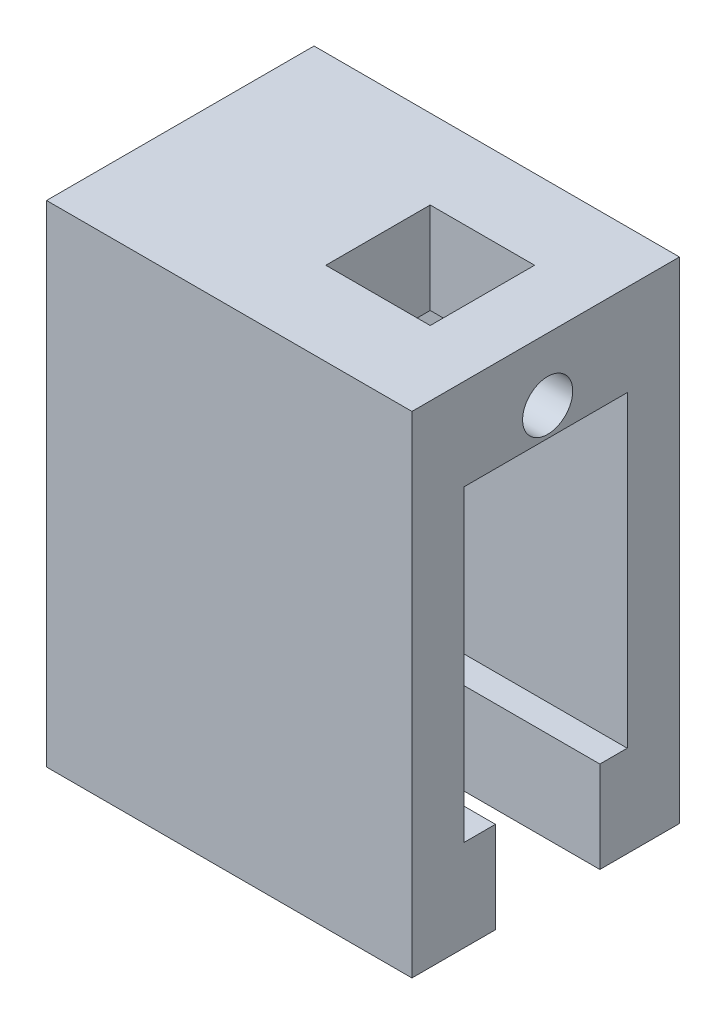
ISO-10303-21;
HEADER;
FILE_DESCRIPTION(('STEP AP214'),'2;1');
FILE_NAME('part.step','',(''),(''),'','','');
FILE_SCHEMA(('AUTOMOTIVE_DESIGN { 1 0 10303 214 1 1 1 1 }'));
ENDSEC;
DATA;
#1=APPLICATION_CONTEXT('core data for automotive mechanical design processes');
#2=APPLICATION_PROTOCOL_DEFINITION('international standard','automotive_design',2000,#1);
#3=PRODUCT_CONTEXT('',#1,'mechanical');
#4=PRODUCT('Part','Part','',(#3));
#5=PRODUCT_RELATED_PRODUCT_CATEGORY('part','',(#4));
#6=PRODUCT_DEFINITION_FORMATION('','',#4);
#7=PRODUCT_DEFINITION_CONTEXT('part definition',#1,'design');
#8=PRODUCT_DEFINITION('design','',#6,#7);
#9=PRODUCT_DEFINITION_SHAPE('','',#8);
#10=(LENGTH_UNIT() NAMED_UNIT(*) SI_UNIT(.MILLI.,.METRE.));
#11=(NAMED_UNIT(*) PLANE_ANGLE_UNIT() SI_UNIT($,.RADIAN.));
#12=(NAMED_UNIT(*) SI_UNIT($,.STERADIAN.) SOLID_ANGLE_UNIT());
#13=UNCERTAINTY_MEASURE_WITH_UNIT(LENGTH_MEASURE(1.E-05),#10,'distance_accuracy_value','');
#14=(GEOMETRIC_REPRESENTATION_CONTEXT(3) GLOBAL_UNCERTAINTY_ASSIGNED_CONTEXT((#13)) GLOBAL_UNIT_ASSIGNED_CONTEXT((#10,
#11,#12)) REPRESENTATION_CONTEXT('',''));
#15=CARTESIAN_POINT('',(0.,0.,0.));
#16=DIRECTION('',(0.,0.,1.));
#17=DIRECTION('',(1.,0.,0.));
#18=AXIS2_PLACEMENT_3D('',#15,#16,#17);
#19=CARTESIAN_POINT('',(28.,0.,0.));
#20=DIRECTION('',(-1.,0.,0.));
#21=DIRECTION('',(0.,0.,1.));
#22=AXIS2_PLACEMENT_3D('',#19,#20,#21);
#23=PLANE('',#22);
#24=CARTESIAN_POINT('',(28.,13.45,0.));
#25=DIRECTION('',(1.,0.,0.));
#26=DIRECTION('',(0.,0.,-1.));
#27=AXIS2_PLACEMENT_3D('',#24,#25,#26);
#28=CIRCLE('',#27,1.92);
#29=CARTESIAN_POINT('',(28.,13.45,-1.92));
#30=VERTEX_POINT('',#29);
#31=EDGE_CURVE('E211',#30,#30,#28,.T.);
#32=ORIENTED_EDGE('',*,*,#31,.F.);
#33=EDGE_LOOP('',(#32));
#34=FACE_BOUND('',#33,.T.);
#35=DIRECTION('',(0.,0.,-1.));
#36=VECTOR('',#35,1.);
#37=CARTESIAN_POINT('',(28.,-19.35,10.4));
#38=LINE('',#37,#36);
#39=CARTESIAN_POINT('',(28.,-19.35,10.4));
#40=VERTEX_POINT('',#39);
#41=CARTESIAN_POINT('',(28.,-19.35,4.));
#42=VERTEX_POINT('',#41);
#43=EDGE_CURVE('E257',#40,#42,#38,.T.);
#44=ORIENTED_EDGE('',*,*,#43,.T.);
#45=DIRECTION('',(0.,-1.,0.));
#46=VECTOR('',#45,1.);
#47=CARTESIAN_POINT('',(28.,-12.35,4.));
#48=LINE('',#47,#46);
#49=CARTESIAN_POINT('',(28.,-12.35,4.));
#50=VERTEX_POINT('',#49);
#51=EDGE_CURVE('E153',#50,#42,#48,.T.);
#52=ORIENTED_EDGE('',*,*,#51,.F.);
#53=DIRECTION('',(0.,0.,-1.));
#54=VECTOR('',#53,1.);
#55=CARTESIAN_POINT('',(28.,-12.35,6.4));
#56=LINE('',#55,#54);
#57=CARTESIAN_POINT('',(28.,-12.35,6.4));
#58=VERTEX_POINT('',#57);
#59=EDGE_CURVE('E224',#58,#50,#56,.T.);
#60=ORIENTED_EDGE('',*,*,#59,.F.);
#61=DIRECTION('',(0.,-1.,0.));
#62=VECTOR('',#61,1.);
#63=CARTESIAN_POINT('',(28.,-12.35,6.4));
#64=LINE('',#63,#62);
#65=CARTESIAN_POINT('',(28.,11.25,6.4));
#66=VERTEX_POINT('',#65);
#67=EDGE_CURVE('E220',#66,#58,#64,.T.);
#68=ORIENTED_EDGE('',*,*,#67,.F.);
#69=DIRECTION('',(0.,0.,1.));
#70=VECTOR('',#69,1.);
#71=CARTESIAN_POINT('',(28.,11.25,6.4));
#72=LINE('',#71,#70);
#73=CARTESIAN_POINT('',(28.,11.25,-6.1));
#74=VERTEX_POINT('',#73);
#75=EDGE_CURVE('E217',#74,#66,#72,.T.);
#76=ORIENTED_EDGE('',*,*,#75,.F.);
#77=DIRECTION('',(0.,1.,0.));
#78=VECTOR('',#77,1.);
#79=CARTESIAN_POINT('',(28.,-12.35,-6.1));
#80=LINE('',#79,#78);
#81=CARTESIAN_POINT('',(28.,-12.35,-6.1));
#82=VERTEX_POINT('',#81);
#83=EDGE_CURVE('E215',#82,#74,#80,.T.);
#84=ORIENTED_EDGE('',*,*,#83,.F.);
#85=CARTESIAN_POINT('',(28.,-12.35,-4.));
#86=VERTEX_POINT('',#85);
#87=EDGE_CURVE('E223',#86,#82,#56,.T.);
#88=ORIENTED_EDGE('',*,*,#87,.F.);
#89=DIRECTION('',(0.,1.,0.));
#90=VECTOR('',#89,1.);
#91=CARTESIAN_POINT('',(28.,-12.35,-4.));
#92=LINE('',#91,#90);
#93=CARTESIAN_POINT('',(28.,-19.35,-4.));
#94=VERTEX_POINT('',#93);
#95=EDGE_CURVE('E166',#94,#86,#92,.T.);
#96=ORIENTED_EDGE('',*,*,#95,.F.);
#97=CARTESIAN_POINT('',(28.,-19.35,-10.1));
#98=VERTEX_POINT('',#97);
#99=EDGE_CURVE('E256',#94,#98,#38,.T.);
#100=ORIENTED_EDGE('',*,*,#99,.T.);
#101=DIRECTION('',(0.,1.,0.));
#102=VECTOR('',#101,1.);
#103=CARTESIAN_POINT('',(28.,-19.35,-10.1));
#104=LINE('',#103,#102);
#105=CARTESIAN_POINT('',(28.,18.25,-10.1));
#106=VERTEX_POINT('',#105);
#107=EDGE_CURVE('E248',#98,#106,#104,.T.);
#108=ORIENTED_EDGE('',*,*,#107,.T.);
#109=DIRECTION('',(0.,0.,1.));
#110=VECTOR('',#109,1.);
#111=CARTESIAN_POINT('',(28.,18.25,10.4));
#112=LINE('',#111,#110);
#113=CARTESIAN_POINT('',(28.,18.25,10.4));
#114=VERTEX_POINT('',#113);
#115=EDGE_CURVE('E251',#106,#114,#112,.T.);
#116=ORIENTED_EDGE('',*,*,#115,.T.);
#117=DIRECTION('',(0.,-1.,0.));
#118=VECTOR('',#117,1.);
#119=CARTESIAN_POINT('',(28.,-19.35,10.4));
#120=LINE('',#119,#118);
#121=EDGE_CURVE('E254',#114,#40,#120,.T.);
#122=ORIENTED_EDGE('',*,*,#121,.T.);
#123=EDGE_LOOP('',(#44,#52,#60,#68,#76,#84,#88,#96,#100,#108,#116,#122));
#124=FACE_BOUND('',#123,.T.);
#125=ADVANCED_FACE('F34',(#34,#124),#23,.F.);
#126=CARTESIAN_POINT('',(0.,0.,0.));
#127=DIRECTION('',(-1.,0.,0.));
#128=DIRECTION('',(0.,0.,1.));
#129=AXIS2_PLACEMENT_3D('',#126,#127,#128);
#130=PLANE('',#129);
#131=DIRECTION('',(0.,1.,0.));
#132=VECTOR('',#131,1.);
#133=CARTESIAN_POINT('',(0.,-19.35,-10.1));
#134=LINE('',#133,#132);
#135=CARTESIAN_POINT('',(0.,-19.35,-10.1));
#136=VERTEX_POINT('',#135);
#137=CARTESIAN_POINT('',(0.,18.25,-10.1));
#138=VERTEX_POINT('',#137);
#139=EDGE_CURVE('E247',#136,#138,#134,.T.);
#140=ORIENTED_EDGE('',*,*,#139,.F.);
#141=DIRECTION('',(0.,0.,-1.));
#142=VECTOR('',#141,1.);
#143=CARTESIAN_POINT('',(0.,-19.35,10.4));
#144=LINE('',#143,#142);
#145=CARTESIAN_POINT('',(0.,-19.35,10.4));
#146=VERTEX_POINT('',#145);
#147=EDGE_CURVE('E252',#146,#136,#144,.T.);
#148=ORIENTED_EDGE('',*,*,#147,.F.);
#149=DIRECTION('',(0.,-1.,0.));
#150=VECTOR('',#149,1.);
#151=CARTESIAN_POINT('',(0.,-19.35,10.4));
#152=LINE('',#151,#150);
#153=CARTESIAN_POINT('',(0.,18.25,10.4));
#154=VERTEX_POINT('',#153);
#155=EDGE_CURVE('E264',#154,#146,#152,.T.);
#156=ORIENTED_EDGE('',*,*,#155,.F.);
#157=DIRECTION('',(0.,0.,1.));
#158=VECTOR('',#157,1.);
#159=CARTESIAN_POINT('',(0.,18.25,10.4));
#160=LINE('',#159,#158);
#161=EDGE_CURVE('E262',#138,#154,#160,.T.);
#162=ORIENTED_EDGE('',*,*,#161,.F.);
#163=EDGE_LOOP('',(#140,#148,#156,#162));
#164=FACE_BOUND('',#163,.T.);
#165=DIRECTION('',(0.,0.,-1.));
#166=VECTOR('',#165,1.);
#167=CARTESIAN_POINT('',(0.,-12.35,6.4));
#168=LINE('',#167,#166);
#169=CARTESIAN_POINT('',(0.,-12.35,6.4));
#170=VERTEX_POINT('',#169);
#171=CARTESIAN_POINT('',(0.,-12.35,-6.1));
#172=VERTEX_POINT('',#171);
#173=EDGE_CURVE('E218',#170,#172,#168,.T.);
#174=ORIENTED_EDGE('',*,*,#173,.T.);
#175=DIRECTION('',(0.,1.,0.));
#176=VECTOR('',#175,1.);
#177=CARTESIAN_POINT('',(0.,-12.35,-6.1));
#178=LINE('',#177,#176);
#179=CARTESIAN_POINT('',(0.,11.25,-6.1));
#180=VERTEX_POINT('',#179);
#181=EDGE_CURVE('E214',#172,#180,#178,.T.);
#182=ORIENTED_EDGE('',*,*,#181,.T.);
#183=DIRECTION('',(0.,0.,1.));
#184=VECTOR('',#183,1.);
#185=CARTESIAN_POINT('',(0.,11.25,6.4));
#186=LINE('',#185,#184);
#187=CARTESIAN_POINT('',(0.,11.25,6.4));
#188=VERTEX_POINT('',#187);
#189=EDGE_CURVE('E230',#180,#188,#186,.T.);
#190=ORIENTED_EDGE('',*,*,#189,.T.);
#191=DIRECTION('',(0.,-1.,0.));
#192=VECTOR('',#191,1.);
#193=CARTESIAN_POINT('',(0.,-12.35,6.4));
#194=LINE('',#193,#192);
#195=EDGE_CURVE('E233',#188,#170,#194,.T.);
#196=ORIENTED_EDGE('',*,*,#195,.T.);
#197=EDGE_LOOP('',(#174,#182,#190,#196));
#198=FACE_BOUND('',#197,.T.);
#199=ADVANCED_FACE('F283',(#164,#198),#130,.T.);
#200=CARTESIAN_POINT('',(28.,-19.35,-10.1));
#201=DIRECTION('',(0.,0.,1.));
#202=DIRECTION('',(1.,0.,0.));
#203=AXIS2_PLACEMENT_3D('',#200,#201,#202);
#204=PLANE('',#203);
#205=ORIENTED_EDGE('',*,*,#139,.T.);
#206=DIRECTION('',(-1.,0.,0.));
#207=VECTOR('',#206,1.);
#208=CARTESIAN_POINT('',(28.,18.25,-10.1));
#209=LINE('',#208,#207);
#210=EDGE_CURVE('E11',#106,#138,#209,.T.);
#211=ORIENTED_EDGE('',*,*,#210,.F.);
#212=ORIENTED_EDGE('',*,*,#107,.F.);
#213=DIRECTION('',(-1.,0.,0.));
#214=VECTOR('',#213,1.);
#215=CARTESIAN_POINT('',(28.,-19.35,-10.1));
#216=LINE('',#215,#214);
#217=EDGE_CURVE('E259',#98,#136,#216,.T.);
#218=ORIENTED_EDGE('',*,*,#217,.T.);
#219=EDGE_LOOP('',(#205,#211,#212,#218));
#220=FACE_BOUND('',#219,.T.);
#221=ADVANCED_FACE('F36',(#220),#204,.F.);
#222=CARTESIAN_POINT('',(28.,18.25,10.4));
#223=DIRECTION('',(0.,-1.,0.));
#224=DIRECTION('',(0.,0.,-1.));
#225=AXIS2_PLACEMENT_3D('',#222,#223,#224);
#226=PLANE('',#225);
#227=DIRECTION('',(-1.,0.,0.));
#228=VECTOR('',#227,1.);
#229=CARTESIAN_POINT('',(23.,18.25,-4.));
#230=LINE('',#229,#228);
#231=CARTESIAN_POINT('',(23.,18.25,-4.));
#232=VERTEX_POINT('',#231);
#233=CARTESIAN_POINT('',(15.,18.25,-4.));
#234=VERTEX_POINT('',#233);
#235=EDGE_CURVE('E58',#232,#234,#230,.T.);
#236=ORIENTED_EDGE('',*,*,#235,.F.);
#237=DIRECTION('',(0.,0.,1.));
#238=VECTOR('',#237,1.);
#239=CARTESIAN_POINT('',(23.,18.25,4.));
#240=LINE('',#239,#238);
#241=CARTESIAN_POINT('',(23.,18.25,4.));
#242=VERTEX_POINT('',#241);
#243=EDGE_CURVE('E189',#232,#242,#240,.T.);
#244=ORIENTED_EDGE('',*,*,#243,.T.);
#245=DIRECTION('',(-1.,0.,0.));
#246=VECTOR('',#245,1.);
#247=CARTESIAN_POINT('',(23.,18.25,4.));
#248=LINE('',#247,#246);
#249=CARTESIAN_POINT('',(15.,18.25,4.));
#250=VERTEX_POINT('',#249);
#251=EDGE_CURVE('E204',#242,#250,#248,.T.);
#252=ORIENTED_EDGE('',*,*,#251,.T.);
#253=DIRECTION('',(0.,0.,1.));
#254=VECTOR('',#253,1.);
#255=CARTESIAN_POINT('',(15.,18.25,4.));
#256=LINE('',#255,#254);
#257=EDGE_CURVE('E199',#234,#250,#256,.T.);
#258=ORIENTED_EDGE('',*,*,#257,.F.);
#259=EDGE_LOOP('',(#236,#244,#252,#258));
#260=FACE_BOUND('',#259,.T.);
#261=ORIENTED_EDGE('',*,*,#161,.T.);
#262=DIRECTION('',(-1.,0.,0.));
#263=VECTOR('',#262,1.);
#264=CARTESIAN_POINT('',(28.,18.25,10.4));
#265=LINE('',#264,#263);
#266=EDGE_CURVE('E43',#114,#154,#265,.T.);
#267=ORIENTED_EDGE('',*,*,#266,.F.);
#268=ORIENTED_EDGE('',*,*,#115,.F.);
#269=ORIENTED_EDGE('',*,*,#210,.T.);
#270=EDGE_LOOP('',(#261,#267,#268,#269));
#271=FACE_BOUND('',#270,.T.);
#272=ADVANCED_FACE('F317',(#260,#271),#226,.F.);
#273=CARTESIAN_POINT('',(28.,-19.35,10.4));
#274=DIRECTION('',(0.,0.,-1.));
#275=DIRECTION('',(-1.,0.,0.));
#276=AXIS2_PLACEMENT_3D('',#273,#274,#275);
#277=PLANE('',#276);
#278=ORIENTED_EDGE('',*,*,#155,.T.);
#279=DIRECTION('',(-1.,0.,0.));
#280=VECTOR('',#279,1.);
#281=CARTESIAN_POINT('',(28.,-19.35,10.4));
#282=LINE('',#281,#280);
#283=EDGE_CURVE('E269',#40,#146,#282,.T.);
#284=ORIENTED_EDGE('',*,*,#283,.F.);
#285=ORIENTED_EDGE('',*,*,#121,.F.);
#286=ORIENTED_EDGE('',*,*,#266,.T.);
#287=EDGE_LOOP('',(#278,#284,#285,#286));
#288=FACE_BOUND('',#287,.T.);
#289=ADVANCED_FACE('F277',(#288),#277,.F.);
#290=CARTESIAN_POINT('',(28.,-19.35,10.4));
#291=DIRECTION('',(0.,1.,0.));
#292=DIRECTION('',(0.,0.,1.));
#293=AXIS2_PLACEMENT_3D('',#290,#291,#292);
#294=PLANE('',#293);
#295=DIRECTION('',(0.,0.,-1.));
#296=VECTOR('',#295,1.);
#297=CARTESIAN_POINT('',(8.,-19.35,4.));
#298=LINE('',#297,#296);
#299=CARTESIAN_POINT('',(8.,-19.35,4.));
#300=VERTEX_POINT('',#299);
#301=CARTESIAN_POINT('',(8.,-19.35,-4.));
#302=VERTEX_POINT('',#301);
#303=EDGE_CURVE('E162',#300,#302,#298,.T.);
#304=ORIENTED_EDGE('',*,*,#303,.F.);
#305=DIRECTION('',(1.,0.,0.));
#306=VECTOR('',#305,1.);
#307=CARTESIAN_POINT('',(8.,-19.35,4.));
#308=LINE('',#307,#306);
#309=EDGE_CURVE('E148',#300,#42,#308,.T.);
#310=ORIENTED_EDGE('',*,*,#309,.T.);
#311=ORIENTED_EDGE('',*,*,#43,.F.);
#312=ORIENTED_EDGE('',*,*,#283,.T.);
#313=ORIENTED_EDGE('',*,*,#147,.T.);
#314=ORIENTED_EDGE('',*,*,#217,.F.);
#315=ORIENTED_EDGE('',*,*,#99,.F.);
#316=DIRECTION('',(1.,0.,0.));
#317=VECTOR('',#316,1.);
#318=CARTESIAN_POINT('',(8.,-19.35,-4.));
#319=LINE('',#318,#317);
#320=EDGE_CURVE('E158',#302,#94,#319,.T.);
#321=ORIENTED_EDGE('',*,*,#320,.F.);
#322=EDGE_LOOP('',(#304,#310,#311,#312,#313,#314,#315,#321));
#323=FACE_BOUND('',#322,.T.);
#324=ADVANCED_FACE('F168',(#323),#294,.F.);
#325=CARTESIAN_POINT('',(28.,-12.35,-6.1));
#326=DIRECTION('',(0.,0.,1.));
#327=DIRECTION('',(1.,0.,0.));
#328=AXIS2_PLACEMENT_3D('',#325,#326,#327);
#329=PLANE('',#328);
#330=ORIENTED_EDGE('',*,*,#181,.F.);
#331=DIRECTION('',(-1.,0.,0.));
#332=VECTOR('',#331,1.);
#333=CARTESIAN_POINT('',(28.,-12.35,-6.1));
#334=LINE('',#333,#332);
#335=EDGE_CURVE('E227',#82,#172,#334,.T.);
#336=ORIENTED_EDGE('',*,*,#335,.F.);
#337=ORIENTED_EDGE('',*,*,#83,.T.);
#338=DIRECTION('',(-1.,0.,0.));
#339=VECTOR('',#338,1.);
#340=CARTESIAN_POINT('',(28.,11.25,-6.1));
#341=LINE('',#340,#339);
#342=EDGE_CURVE('E244',#74,#180,#341,.T.);
#343=ORIENTED_EDGE('',*,*,#342,.T.);
#344=EDGE_LOOP('',(#330,#336,#337,#343));
#345=FACE_BOUND('',#344,.T.);
#346=ADVANCED_FACE('F310',(#345),#329,.T.);
#347=CARTESIAN_POINT('',(28.,11.25,6.4));
#348=DIRECTION('',(0.,-1.,0.));
#349=DIRECTION('',(0.,0.,-1.));
#350=AXIS2_PLACEMENT_3D('',#347,#348,#349);
#351=PLANE('',#350);
#352=DIRECTION('',(0.,0.,-1.));
#353=VECTOR('',#352,1.);
#354=CARTESIAN_POINT('',(23.,11.25,4.));
#355=LINE('',#354,#353);
#356=CARTESIAN_POINT('',(23.,11.25,4.));
#357=VERTEX_POINT('',#356);
#358=CARTESIAN_POINT('',(23.,11.25,-4.));
#359=VERTEX_POINT('',#358);
#360=EDGE_CURVE('E183',#357,#359,#355,.T.);
#361=ORIENTED_EDGE('',*,*,#360,.T.);
#362=DIRECTION('',(-1.,0.,0.));
#363=VECTOR('',#362,1.);
#364=CARTESIAN_POINT('',(23.,11.25,-4.));
#365=LINE('',#364,#363);
#366=CARTESIAN_POINT('',(15.,11.25,-4.));
#367=VERTEX_POINT('',#366);
#368=EDGE_CURVE('E208',#359,#367,#365,.T.);
#369=ORIENTED_EDGE('',*,*,#368,.T.);
#370=DIRECTION('',(0.,0.,-1.));
#371=VECTOR('',#370,1.);
#372=CARTESIAN_POINT('',(15.,11.25,4.));
#373=LINE('',#372,#371);
#374=CARTESIAN_POINT('',(15.,11.25,4.));
#375=VERTEX_POINT('',#374);
#376=EDGE_CURVE('E178',#375,#367,#373,.T.);
#377=ORIENTED_EDGE('',*,*,#376,.F.);
#378=DIRECTION('',(-1.,0.,0.));
#379=VECTOR('',#378,1.);
#380=CARTESIAN_POINT('',(23.,11.25,4.));
#381=LINE('',#380,#379);
#382=EDGE_CURVE('E194',#357,#375,#381,.T.);
#383=ORIENTED_EDGE('',*,*,#382,.F.);
#384=EDGE_LOOP('',(#361,#369,#377,#383));
#385=FACE_BOUND('',#384,.T.);
#386=ORIENTED_EDGE('',*,*,#189,.F.);
#387=ORIENTED_EDGE('',*,*,#342,.F.);
#388=ORIENTED_EDGE('',*,*,#75,.T.);
#389=DIRECTION('',(-1.,0.,0.));
#390=VECTOR('',#389,1.);
#391=CARTESIAN_POINT('',(28.,11.25,6.4));
#392=LINE('',#391,#390);
#393=EDGE_CURVE('E242',#66,#188,#392,.T.);
#394=ORIENTED_EDGE('',*,*,#393,.T.);
#395=EDGE_LOOP('',(#386,#387,#388,#394));
#396=FACE_BOUND('',#395,.T.);
#397=ADVANCED_FACE('F307',(#385,#396),#351,.T.);
#398=CARTESIAN_POINT('',(28.,-12.35,6.4));
#399=DIRECTION('',(0.,0.,-1.));
#400=DIRECTION('',(-1.,0.,0.));
#401=AXIS2_PLACEMENT_3D('',#398,#399,#400);
#402=PLANE('',#401);
#403=ORIENTED_EDGE('',*,*,#195,.F.);
#404=ORIENTED_EDGE('',*,*,#393,.F.);
#405=ORIENTED_EDGE('',*,*,#67,.T.);
#406=DIRECTION('',(-1.,0.,0.));
#407=VECTOR('',#406,1.);
#408=CARTESIAN_POINT('',(28.,-12.35,6.4));
#409=LINE('',#408,#407);
#410=EDGE_CURVE('E240',#58,#170,#409,.T.);
#411=ORIENTED_EDGE('',*,*,#410,.T.);
#412=EDGE_LOOP('',(#403,#404,#405,#411));
#413=FACE_BOUND('',#412,.T.);
#414=ADVANCED_FACE('F304',(#413),#402,.T.);
#415=CARTESIAN_POINT('',(28.,-12.35,6.4));
#416=DIRECTION('',(0.,1.,0.));
#417=DIRECTION('',(0.,0.,1.));
#418=AXIS2_PLACEMENT_3D('',#415,#416,#417);
#419=PLANE('',#418);
#420=DIRECTION('',(1.,0.,0.));
#421=VECTOR('',#420,1.);
#422=CARTESIAN_POINT('',(8.,-12.35,4.));
#423=LINE('',#422,#421);
#424=CARTESIAN_POINT('',(8.,-12.35,4.));
#425=VERTEX_POINT('',#424);
#426=EDGE_CURVE('E176',#425,#50,#423,.T.);
#427=ORIENTED_EDGE('',*,*,#426,.F.);
#428=DIRECTION('',(0.,0.,1.));
#429=VECTOR('',#428,1.);
#430=CARTESIAN_POINT('',(8.,-12.35,-4.));
#431=LINE('',#430,#429);
#432=CARTESIAN_POINT('',(8.,-12.35,-4.));
#433=VERTEX_POINT('',#432);
#434=EDGE_CURVE('E159',#433,#425,#431,.T.);
#435=ORIENTED_EDGE('',*,*,#434,.F.);
#436=DIRECTION('',(1.,0.,0.));
#437=VECTOR('',#436,1.);
#438=CARTESIAN_POINT('',(8.,-12.35,-4.));
#439=LINE('',#438,#437);
#440=EDGE_CURVE('E179',#433,#86,#439,.T.);
#441=ORIENTED_EDGE('',*,*,#440,.T.);
#442=ORIENTED_EDGE('',*,*,#87,.T.);
#443=ORIENTED_EDGE('',*,*,#335,.T.);
#444=ORIENTED_EDGE('',*,*,#173,.F.);
#445=ORIENTED_EDGE('',*,*,#410,.F.);
#446=ORIENTED_EDGE('',*,*,#59,.T.);
#447=EDGE_LOOP('',(#427,#435,#441,#442,#443,#444,#445,#446));
#448=FACE_BOUND('',#447,.T.);
#449=ADVANCED_FACE('F296',(#448),#419,.T.);
#450=CARTESIAN_POINT('',(15.,13.45,0.));
#451=DIRECTION('',(1.,0.,0.));
#452=DIRECTION('',(0.,0.,-1.));
#453=AXIS2_PLACEMENT_3D('',#450,#451,#452);
#454=CYLINDRICAL_SURFACE('',#453,1.92);
#455=CARTESIAN_POINT('',(23.,13.45,0.));
#456=DIRECTION('',(1.,0.,0.));
#457=DIRECTION('',(0.,0.,-1.));
#458=AXIS2_PLACEMENT_3D('',#455,#456,#457);
#459=CIRCLE('',#458,1.92);
#460=CARTESIAN_POINT('',(23.,13.45,-1.92));
#461=VERTEX_POINT('',#460);
#462=EDGE_CURVE('E38',#461,#461,#459,.F.);
#463=ORIENTED_EDGE('',*,*,#462,.T.);
#464=EDGE_LOOP('',(#463));
#465=FACE_BOUND('',#464,.T.);
#466=ORIENTED_EDGE('',*,*,#31,.T.);
#467=EDGE_LOOP('',(#466));
#468=FACE_BOUND('',#467,.T.);
#469=ADVANCED_FACE('F347',(#465,#468),#454,.F.);
#470=CARTESIAN_POINT('',(23.,0.,0.));
#471=DIRECTION('',(1.,0.,0.));
#472=DIRECTION('',(0.,0.,-1.));
#473=AXIS2_PLACEMENT_3D('',#470,#471,#472);
#474=PLANE('',#473);
#475=ORIENTED_EDGE('',*,*,#360,.F.);
#476=DIRECTION('',(0.,-1.,0.));
#477=VECTOR('',#476,1.);
#478=CARTESIAN_POINT('',(23.,11.25,4.));
#479=LINE('',#478,#477);
#480=EDGE_CURVE('E192',#242,#357,#479,.T.);
#481=ORIENTED_EDGE('',*,*,#480,.F.);
#482=ORIENTED_EDGE('',*,*,#243,.F.);
#483=DIRECTION('',(0.,1.,0.));
#484=VECTOR('',#483,1.);
#485=CARTESIAN_POINT('',(23.,11.25,-4.));
#486=LINE('',#485,#484);
#487=EDGE_CURVE('E186',#359,#232,#486,.T.);
#488=ORIENTED_EDGE('',*,*,#487,.F.);
#489=EDGE_LOOP('',(#475,#481,#482,#488));
#490=FACE_BOUND('',#489,.T.);
#491=ORIENTED_EDGE('',*,*,#462,.F.);
#492=EDGE_LOOP('',(#491));
#493=FACE_BOUND('',#492,.T.);
#494=ADVANCED_FACE('F344',(#490,#493),#474,.F.);
#495=CARTESIAN_POINT('',(23.,11.25,-4.));
#496=DIRECTION('',(0.,0.,1.));
#497=DIRECTION('',(0.,-1.,0.));
#498=AXIS2_PLACEMENT_3D('',#495,#496,#497);
#499=PLANE('',#498);
#500=DIRECTION('',(0.,1.,0.));
#501=VECTOR('',#500,1.);
#502=CARTESIAN_POINT('',(15.,11.25,-4.));
#503=LINE('',#502,#501);
#504=EDGE_CURVE('E197',#367,#234,#503,.T.);
#505=ORIENTED_EDGE('',*,*,#504,.F.);
#506=ORIENTED_EDGE('',*,*,#368,.F.);
#507=ORIENTED_EDGE('',*,*,#487,.T.);
#508=ORIENTED_EDGE('',*,*,#235,.T.);
#509=EDGE_LOOP('',(#505,#506,#507,#508));
#510=FACE_BOUND('',#509,.T.);
#511=ADVANCED_FACE('F342',(#510),#499,.T.);
#512=CARTESIAN_POINT('',(23.,11.25,4.));
#513=DIRECTION('',(0.,0.,-1.));
#514=DIRECTION('',(0.,1.,0.));
#515=AXIS2_PLACEMENT_3D('',#512,#513,#514);
#516=PLANE('',#515);
#517=DIRECTION('',(0.,-1.,0.));
#518=VECTOR('',#517,1.);
#519=CARTESIAN_POINT('',(15.,11.25,4.));
#520=LINE('',#519,#518);
#521=EDGE_CURVE('E187',#250,#375,#520,.T.);
#522=ORIENTED_EDGE('',*,*,#521,.F.);
#523=ORIENTED_EDGE('',*,*,#251,.F.);
#524=ORIENTED_EDGE('',*,*,#480,.T.);
#525=ORIENTED_EDGE('',*,*,#382,.T.);
#526=EDGE_LOOP('',(#522,#523,#524,#525));
#527=FACE_BOUND('',#526,.T.);
#528=ADVANCED_FACE('F336',(#527),#516,.T.);
#529=CARTESIAN_POINT('',(15.,13.45,0.));
#530=DIRECTION('',(1.,0.,0.));
#531=DIRECTION('',(0.,0.,-1.));
#532=AXIS2_PLACEMENT_3D('',#529,#530,#531);
#533=PLANE('',#532);
#534=ORIENTED_EDGE('',*,*,#376,.T.);
#535=ORIENTED_EDGE('',*,*,#504,.T.);
#536=ORIENTED_EDGE('',*,*,#257,.T.);
#537=ORIENTED_EDGE('',*,*,#521,.T.);
#538=EDGE_LOOP('',(#534,#535,#536,#537));
#539=FACE_BOUND('',#538,.T.);
#540=ADVANCED_FACE('F333',(#539),#533,.T.);
#541=CARTESIAN_POINT('',(8.,-12.35,4.));
#542=DIRECTION('',(0.,0.,1.));
#543=DIRECTION('',(0.,-1.,0.));
#544=AXIS2_PLACEMENT_3D('',#541,#542,#543);
#545=PLANE('',#544);
#546=ORIENTED_EDGE('',*,*,#51,.T.);
#547=ORIENTED_EDGE('',*,*,#309,.F.);
#548=DIRECTION('',(0.,-1.,0.));
#549=VECTOR('',#548,1.);
#550=CARTESIAN_POINT('',(8.,-12.35,4.));
#551=LINE('',#550,#549);
#552=EDGE_CURVE('E151',#425,#300,#551,.T.);
#553=ORIENTED_EDGE('',*,*,#552,.F.);
#554=ORIENTED_EDGE('',*,*,#426,.T.);
#555=EDGE_LOOP('',(#546,#547,#553,#554));
#556=FACE_BOUND('',#555,.T.);
#557=ADVANCED_FACE('F150',(#556),#545,.F.);
#558=CARTESIAN_POINT('',(8.,-12.35,-4.));
#559=DIRECTION('',(0.,0.,-1.));
#560=DIRECTION('',(0.,1.,0.));
#561=AXIS2_PLACEMENT_3D('',#558,#559,#560);
#562=PLANE('',#561);
#563=ORIENTED_EDGE('',*,*,#95,.T.);
#564=ORIENTED_EDGE('',*,*,#440,.F.);
#565=DIRECTION('',(0.,1.,0.));
#566=VECTOR('',#565,1.);
#567=CARTESIAN_POINT('',(8.,-12.35,-4.));
#568=LINE('',#567,#566);
#569=EDGE_CURVE('E50',#302,#433,#568,.T.);
#570=ORIENTED_EDGE('',*,*,#569,.F.);
#571=ORIENTED_EDGE('',*,*,#320,.T.);
#572=EDGE_LOOP('',(#563,#564,#570,#571));
#573=FACE_BOUND('',#572,.T.);
#574=ADVANCED_FACE('F294',(#573),#562,.F.);
#575=CARTESIAN_POINT('',(8.,0.,0.));
#576=DIRECTION('',(1.,0.,0.));
#577=DIRECTION('',(0.,0.,-1.));
#578=AXIS2_PLACEMENT_3D('',#575,#576,#577);
#579=PLANE('',#578);
#580=ORIENTED_EDGE('',*,*,#552,.T.);
#581=ORIENTED_EDGE('',*,*,#303,.T.);
#582=ORIENTED_EDGE('',*,*,#569,.T.);
#583=ORIENTED_EDGE('',*,*,#434,.T.);
#584=EDGE_LOOP('',(#580,#581,#582,#583));
#585=FACE_BOUND('',#584,.T.);
#586=ADVANCED_FACE('F161',(#585),#579,.T.);
#587=CLOSED_SHELL('',(#125,#199,#221,#272,#289,#324,#346,#397,#414,#449,#469,#494,#511,#528,
#540,#557,#574,#586));
#588=MANIFOLD_SOLID_BREP('B2',#587);
#589=ADVANCED_BREP_SHAPE_REPRESENTATION('',(#18,#588),#14);
#590=SHAPE_DEFINITION_REPRESENTATION(#9,#589);
ENDSEC;
END-ISO-10303-21;
